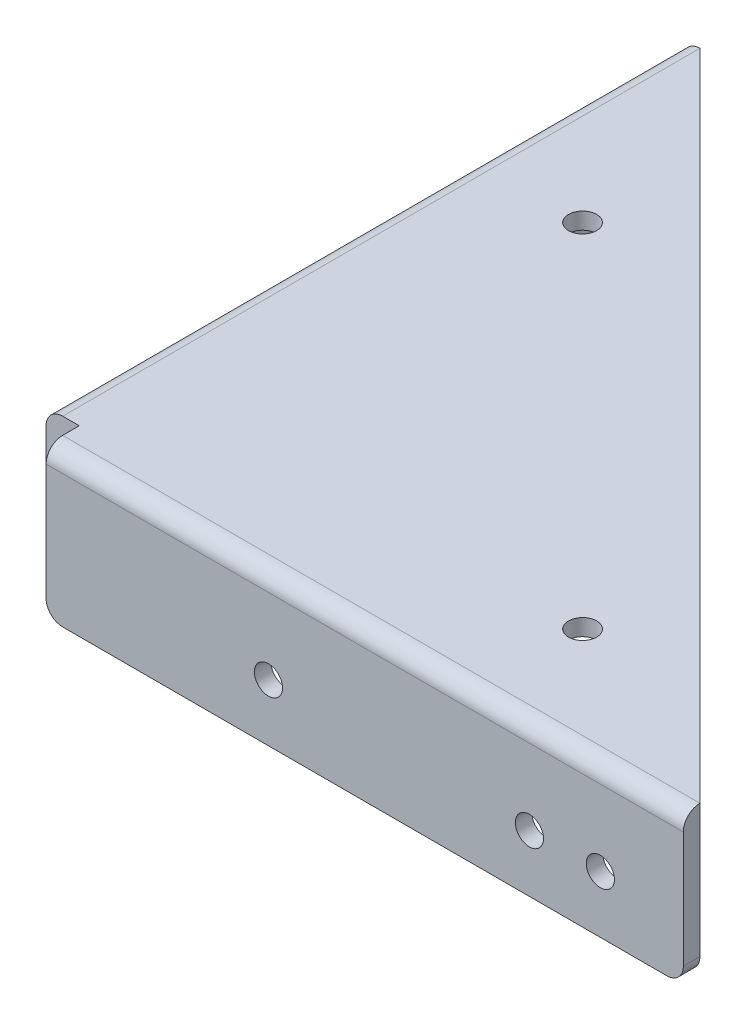
ISO-10303-21;
HEADER;
FILE_DESCRIPTION(('STEP AP214'),'2;1');
FILE_NAME('part.step','',(''),(''),'','','');
FILE_SCHEMA(('AUTOMOTIVE_DESIGN { 1 0 10303 214 1 1 1 1 }'));
ENDSEC;
DATA;
#1=APPLICATION_CONTEXT('core data for automotive mechanical design processes');
#2=APPLICATION_PROTOCOL_DEFINITION('international standard','automotive_design',2000,#1);
#3=PRODUCT_CONTEXT('',#1,'mechanical');
#4=PRODUCT('Part','Part','',(#3));
#5=PRODUCT_RELATED_PRODUCT_CATEGORY('part','',(#4));
#6=PRODUCT_DEFINITION_FORMATION('','',#4);
#7=PRODUCT_DEFINITION_CONTEXT('part definition',#1,'design');
#8=PRODUCT_DEFINITION('design','',#6,#7);
#9=PRODUCT_DEFINITION_SHAPE('','',#8);
#10=(LENGTH_UNIT() NAMED_UNIT(*) SI_UNIT(.MILLI.,.METRE.));
#11=(NAMED_UNIT(*) PLANE_ANGLE_UNIT() SI_UNIT($,.RADIAN.));
#12=(NAMED_UNIT(*) SI_UNIT($,.STERADIAN.) SOLID_ANGLE_UNIT());
#13=UNCERTAINTY_MEASURE_WITH_UNIT(LENGTH_MEASURE(1.E-05),#10,'distance_accuracy_value','');
#14=(GEOMETRIC_REPRESENTATION_CONTEXT(3) GLOBAL_UNCERTAINTY_ASSIGNED_CONTEXT((#13)) GLOBAL_UNIT_ASSIGNED_CONTEXT((#10,
#11,#12)) REPRESENTATION_CONTEXT('',''));
#15=CARTESIAN_POINT('',(0.,0.,0.));
#16=DIRECTION('',(0.,0.,1.));
#17=DIRECTION('',(1.,0.,0.));
#18=AXIS2_PLACEMENT_3D('',#15,#16,#17);
#19=CARTESIAN_POINT('',(0.,22.86,0.));
#20=DIRECTION('',(-1.,0.,0.));
#21=DIRECTION('',(0.,0.,1.));
#22=AXIS2_PLACEMENT_3D('',#19,#20,#21);
#23=PLANE('',#22);
#24=CARTESIAN_POINT('',(0.,8.73125,-79.0575));
#25=DIRECTION('',(-1.,0.,0.));
#26=DIRECTION('',(0.,0.,1.));
#27=AXIS2_PLACEMENT_3D('',#24,#25,#26);
#28=CIRCLE('',#27,2.15899999999999);
#29=CARTESIAN_POINT('',(0.,8.73125,-76.8985));
#30=VERTEX_POINT('',#29);
#31=EDGE_CURVE('E643',#30,#30,#28,.T.);
#32=ORIENTED_EDGE('',*,*,#31,.F.);
#33=EDGE_LOOP('',(#32));
#34=FACE_BOUND('',#33,.T.);
#35=CARTESIAN_POINT('',(0.,8.73125,-39.116));
#36=DIRECTION('',(-1.,0.,0.));
#37=DIRECTION('',(0.,0.,1.));
#38=AXIS2_PLACEMENT_3D('',#35,#36,#37);
#39=CIRCLE('',#38,2.15264999999999);
#40=CARTESIAN_POINT('',(0.,8.73125,-36.96335));
#41=VERTEX_POINT('',#40);
#42=EDGE_CURVE('E254',#41,#41,#39,.T.);
#43=ORIENTED_EDGE('',*,*,#42,.F.);
#44=EDGE_LOOP('',(#43));
#45=FACE_BOUND('',#44,.T.);
#46=CARTESIAN_POINT('',(0.,8.73125,-89.916));
#47=DIRECTION('',(-1.,0.,0.));
#48=DIRECTION('',(0.,0.,1.));
#49=AXIS2_PLACEMENT_3D('',#46,#47,#48);
#50=CIRCLE('',#49,2.15264999999999);
#51=CARTESIAN_POINT('',(0.,8.73125,-87.76335));
#52=VERTEX_POINT('',#51);
#53=EDGE_CURVE('E176',#52,#52,#50,.T.);
#54=ORIENTED_EDGE('',*,*,#53,.F.);
#55=EDGE_LOOP('',(#54));
#56=FACE_BOUND('',#55,.T.);
#57=DIRECTION('',(0.,-1.,0.));
#58=VECTOR('',#57,1.);
#59=CARTESIAN_POINT('',(0.,22.86,-102.616));
#60=LINE('',#59,#58);
#61=CARTESIAN_POINT('',(0.,20.32,-102.616));
#62=VERTEX_POINT('',#61);
#63=CARTESIAN_POINT('',(0.,2.54,-102.616));
#64=VERTEX_POINT('',#63);
#65=EDGE_CURVE('E210',#62,#64,#60,.T.);
#66=ORIENTED_EDGE('',*,*,#65,.T.);
#67=CARTESIAN_POINT('',(0.,2.54,-100.076));
#68=DIRECTION('',(-1.,0.,0.));
#69=DIRECTION('',(0.,0.,1.));
#70=AXIS2_PLACEMENT_3D('',#67,#68,#69);
#71=CIRCLE('',#70,2.54);
#72=CARTESIAN_POINT('',(0.,0.,-100.076));
#73=VERTEX_POINT('',#72);
#74=EDGE_CURVE('E280',#64,#73,#71,.T.);
#75=ORIENTED_EDGE('',*,*,#74,.T.);
#76=DIRECTION('',(0.,0.,-1.));
#77=VECTOR('',#76,1.);
#78=CARTESIAN_POINT('',(0.,0.,0.));
#79=LINE('',#78,#77);
#80=CARTESIAN_POINT('',(0.,0.,-7.61999999999999));
#81=VERTEX_POINT('',#80);
#82=EDGE_CURVE('E202',#81,#73,#79,.T.);
#83=ORIENTED_EDGE('',*,*,#82,.F.);
#84=CARTESIAN_POINT('',(0.,2.54,-7.61999999999999));
#85=DIRECTION('',(-1.,0.,0.));
#86=DIRECTION('',(0.,0.,1.));
#87=AXIS2_PLACEMENT_3D('',#84,#85,#86);
#88=CIRCLE('',#87,2.54);
#89=CARTESIAN_POINT('',(0.,2.54,-5.07999999999999));
#90=VERTEX_POINT('',#89);
#91=EDGE_CURVE('E278',#81,#90,#88,.T.);
#92=ORIENTED_EDGE('',*,*,#91,.T.);
#93=DIRECTION('',(0.,1.,0.));
#94=VECTOR('',#93,1.);
#95=CARTESIAN_POINT('',(0.,22.86,-5.07999999999999));
#96=LINE('',#95,#94);
#97=CARTESIAN_POINT('',(0.,20.32,-5.07999999999999));
#98=VERTEX_POINT('',#97);
#99=EDGE_CURVE('E186',#90,#98,#96,.T.);
#100=ORIENTED_EDGE('',*,*,#99,.T.);
#101=DIRECTION('',(0.,0.,-1.));
#102=VECTOR('',#101,1.);
#103=CARTESIAN_POINT('',(0.,20.32,0.));
#104=LINE('',#103,#102);
#105=EDGE_CURVE('E219',#98,#62,#104,.T.);
#106=ORIENTED_EDGE('',*,*,#105,.T.);
#107=EDGE_LOOP('',(#66,#75,#83,#92,#100,#106));
#108=FACE_BOUND('',#107,.T.);
#109=ADVANCED_FACE('F32',(#34,#45,#56,#108),#23,.T.);
#110=CARTESIAN_POINT('',(0.,22.86,0.));
#111=DIRECTION('',(0.,0.,1.));
#112=DIRECTION('',(1.,0.,0.));
#113=AXIS2_PLACEMENT_3D('',#110,#111,#112);
#114=PLANE('',#113);
#115=CARTESIAN_POINT('',(79.0575,8.73125,0.));
#116=DIRECTION('',(0.,0.,1.));
#117=DIRECTION('',(1.,0.,0.));
#118=AXIS2_PLACEMENT_3D('',#115,#116,#117);
#119=CIRCLE('',#118,2.15899999999999);
#120=CARTESIAN_POINT('',(81.2165,8.73125,0.));
#121=VERTEX_POINT('',#120);
#122=EDGE_CURVE('E649',#121,#121,#119,.T.);
#123=ORIENTED_EDGE('',*,*,#122,.F.);
#124=EDGE_LOOP('',(#123));
#125=FACE_BOUND('',#124,.T.);
#126=CARTESIAN_POINT('',(89.916,8.73125,0.));
#127=DIRECTION('',(0.,0.,1.));
#128=DIRECTION('',(1.,0.,0.));
#129=AXIS2_PLACEMENT_3D('',#126,#127,#128);
#130=CIRCLE('',#129,2.15264999999999);
#131=CARTESIAN_POINT('',(92.06865,8.73125,0.));
#132=VERTEX_POINT('',#131);
#133=EDGE_CURVE('E262',#132,#132,#130,.T.);
#134=ORIENTED_EDGE('',*,*,#133,.F.);
#135=EDGE_LOOP('',(#134));
#136=FACE_BOUND('',#135,.T.);
#137=CARTESIAN_POINT('',(39.116,8.73125,0.));
#138=DIRECTION('',(0.,0.,1.));
#139=DIRECTION('',(1.,0.,0.));
#140=AXIS2_PLACEMENT_3D('',#137,#138,#139);
#141=CIRCLE('',#140,2.15264999999999);
#142=CARTESIAN_POINT('',(41.26865,8.73125,0.));
#143=VERTEX_POINT('',#142);
#144=EDGE_CURVE('E261',#143,#143,#141,.T.);
#145=ORIENTED_EDGE('',*,*,#144,.F.);
#146=EDGE_LOOP('',(#145));
#147=FACE_BOUND('',#146,.T.);
#148=DIRECTION('',(-1.,0.,0.));
#149=VECTOR('',#148,1.);
#150=CARTESIAN_POINT('',(0.,0.,0.));
#151=LINE('',#150,#149);
#152=CARTESIAN_POINT('',(100.076,0.,0.));
#153=VERTEX_POINT('',#152);
#154=CARTESIAN_POINT('',(7.62000000000001,0.,0.));
#155=VERTEX_POINT('',#154);
#156=EDGE_CURVE('E205',#153,#155,#151,.T.);
#157=ORIENTED_EDGE('',*,*,#156,.F.);
#158=CARTESIAN_POINT('',(100.076,2.54,0.));
#159=DIRECTION('',(0.,0.,1.));
#160=DIRECTION('',(1.,0.,0.));
#161=AXIS2_PLACEMENT_3D('',#158,#159,#160);
#162=CIRCLE('',#161,2.54);
#163=CARTESIAN_POINT('',(102.616,2.54,0.));
#164=VERTEX_POINT('',#163);
#165=EDGE_CURVE('E289',#153,#164,#162,.T.);
#166=ORIENTED_EDGE('',*,*,#165,.T.);
#167=DIRECTION('',(0.,-1.,0.));
#168=VECTOR('',#167,1.);
#169=CARTESIAN_POINT('',(102.616,22.86,0.));
#170=LINE('',#169,#168);
#171=CARTESIAN_POINT('',(102.616,20.32,0.));
#172=VERTEX_POINT('',#171);
#173=EDGE_CURVE('E208',#172,#164,#170,.T.);
#174=ORIENTED_EDGE('',*,*,#173,.F.);
#175=DIRECTION('',(-1.,0.,0.));
#176=VECTOR('',#175,1.);
#177=CARTESIAN_POINT('',(0.,20.32,0.));
#178=LINE('',#177,#176);
#179=CARTESIAN_POINT('',(5.08000000000001,20.32,0.));
#180=VERTEX_POINT('',#179);
#181=EDGE_CURVE('E226',#172,#180,#178,.T.);
#182=ORIENTED_EDGE('',*,*,#181,.T.);
#183=DIRECTION('',(0.,-1.,0.));
#184=VECTOR('',#183,1.);
#185=CARTESIAN_POINT('',(5.08000000000001,22.86,0.));
#186=LINE('',#185,#184);
#187=CARTESIAN_POINT('',(5.08000000000001,2.54,0.));
#188=VERTEX_POINT('',#187);
#189=EDGE_CURVE('E161',#180,#188,#186,.T.);
#190=ORIENTED_EDGE('',*,*,#189,.T.);
#191=CARTESIAN_POINT('',(7.62000000000001,2.54,0.));
#192=DIRECTION('',(0.,0.,1.));
#193=DIRECTION('',(1.,0.,0.));
#194=AXIS2_PLACEMENT_3D('',#191,#192,#193);
#195=CIRCLE('',#194,2.54);
#196=EDGE_CURVE('E287',#188,#155,#195,.T.);
#197=ORIENTED_EDGE('',*,*,#196,.T.);
#198=EDGE_LOOP('',(#157,#166,#174,#182,#190,#197));
#199=FACE_BOUND('',#198,.T.);
#200=ADVANCED_FACE('F322',(#125,#136,#147,#199),#114,.T.);
#201=CARTESIAN_POINT('',(0.,22.86,0.));
#202=DIRECTION('',(0.,1.,0.));
#203=DIRECTION('',(0.,0.,1.));
#204=AXIS2_PLACEMENT_3D('',#201,#202,#203);
#205=PLANE('',#204);
#206=CARTESIAN_POINT('',(16.6569755157234,22.86,-70.5385122421383));
#207=DIRECTION('',(0.,1.,0.));
#208=DIRECTION('',(0.,0.,1.));
#209=AXIS2_PLACEMENT_3D('',#206,#207,#208);
#210=CIRCLE('',#209,2.15264999999999);
#211=CARTESIAN_POINT('',(16.6569755157234,22.86,-68.3858622421383));
#212=VERTEX_POINT('',#211);
#213=EDGE_CURVE('E263',#212,#212,#210,.T.);
#214=ORIENTED_EDGE('',*,*,#213,.F.);
#215=EDGE_LOOP('',(#214));
#216=FACE_BOUND('',#215,.T.);
#217=CARTESIAN_POINT('',(70.5385122421383,22.86,-16.6569755157234));
#218=DIRECTION('',(0.,1.,0.));
#219=DIRECTION('',(0.,0.,1.));
#220=AXIS2_PLACEMENT_3D('',#217,#218,#219);
#221=CIRCLE('',#220,2.15264999999999);
#222=CARTESIAN_POINT('',(70.5385122421383,22.86,-14.5043255157234));
#223=VERTEX_POINT('',#222);
#224=EDGE_CURVE('E611',#223,#223,#221,.T.);
#225=ORIENTED_EDGE('',*,*,#224,.F.);
#226=EDGE_LOOP('',(#225));
#227=FACE_BOUND('',#226,.T.);
#228=DIRECTION('',(0.,0.,-1.));
#229=VECTOR('',#228,1.);
#230=CARTESIAN_POINT('',(2.54,22.86,0.));
#231=LINE('',#230,#229);
#232=CARTESIAN_POINT('',(2.54,22.86,-102.616));
#233=VERTEX_POINT('',#232);
#234=CARTESIAN_POINT('',(2.54,22.86,-5.07999999999999));
#235=VERTEX_POINT('',#234);
#236=EDGE_CURVE('E175',#233,#235,#231,.F.);
#237=ORIENTED_EDGE('',*,*,#236,.T.);
#238=DIRECTION('',(1.,0.,0.));
#239=VECTOR('',#238,1.);
#240=CARTESIAN_POINT('',(-2.92435991916569,22.86,-5.07999999999999));
#241=LINE('',#240,#239);
#242=CARTESIAN_POINT('',(5.08000000000001,22.86,-5.07999999999999));
#243=VERTEX_POINT('',#242);
#244=EDGE_CURVE('E154',#235,#243,#241,.T.);
#245=ORIENTED_EDGE('',*,*,#244,.T.);
#246=DIRECTION('',(0.,0.,1.));
#247=VECTOR('',#246,1.);
#248=CARTESIAN_POINT('',(5.08000000000001,22.86,-5.07999999999999));
#249=LINE('',#248,#247);
#250=CARTESIAN_POINT('',(5.08000000000001,22.86,-2.54));
#251=VERTEX_POINT('',#250);
#252=EDGE_CURVE('E162',#243,#251,#249,.T.);
#253=ORIENTED_EDGE('',*,*,#252,.T.);
#254=DIRECTION('',(-1.,0.,0.));
#255=VECTOR('',#254,1.);
#256=CARTESIAN_POINT('',(0.,22.86,-2.54));
#257=LINE('',#256,#255);
#258=CARTESIAN_POINT('',(102.616,22.86,-2.54));
#259=VERTEX_POINT('',#258);
#260=EDGE_CURVE('E223',#251,#259,#257,.F.);
#261=ORIENTED_EDGE('',*,*,#260,.T.);
#262=DIRECTION('',(-0.707106781186547,0.,-0.707106781186547));
#263=VECTOR('',#262,1.);
#264=CARTESIAN_POINT('',(2.54,22.86,-102.616));
#265=LINE('',#264,#263);
#266=EDGE_CURVE('E194',#259,#233,#265,.T.);
#267=ORIENTED_EDGE('',*,*,#266,.T.);
#268=EDGE_LOOP('',(#237,#245,#253,#261,#267));
#269=FACE_BOUND('',#268,.T.);
#270=ADVANCED_FACE('F172',(#216,#227,#269),#205,.T.);
#271=CARTESIAN_POINT('',(0.,0.,0.));
#272=DIRECTION('',(0.,1.,0.));
#273=DIRECTION('',(0.,0.,1.));
#274=AXIS2_PLACEMENT_3D('',#271,#272,#273);
#275=PLANE('',#274);
#276=ORIENTED_EDGE('',*,*,#82,.T.);
#277=DIRECTION('',(1.,0.,0.));
#278=VECTOR('',#277,1.);
#279=CARTESIAN_POINT('',(2.54,0.,-100.076));
#280=LINE('',#279,#278);
#281=CARTESIAN_POINT('',(2.54,0.,-100.076));
#282=VERTEX_POINT('',#281);
#283=EDGE_CURVE('E269',#73,#282,#280,.T.);
#284=ORIENTED_EDGE('',*,*,#283,.T.);
#285=DIRECTION('',(0.,0.,1.));
#286=VECTOR('',#285,1.);
#287=CARTESIAN_POINT('',(2.54000000000001,0.,0.));
#288=LINE('',#287,#286);
#289=CARTESIAN_POINT('',(2.54000000000001,0.,-7.61999999999999));
#290=VERTEX_POINT('',#289);
#291=EDGE_CURVE('E199',#282,#290,#288,.T.);
#292=ORIENTED_EDGE('',*,*,#291,.T.);
#293=DIRECTION('',(1.,0.,0.));
#294=VECTOR('',#293,1.);
#295=CARTESIAN_POINT('',(0.,0.,-7.61999999999999));
#296=LINE('',#295,#294);
#297=EDGE_CURVE('E251',#290,#81,#296,.F.);
#298=ORIENTED_EDGE('',*,*,#297,.T.);
#299=EDGE_LOOP('',(#276,#284,#292,#298));
#300=FACE_BOUND('',#299,.T.);
#301=ADVANCED_FACE('F350',(#300),#275,.F.);
#302=DIRECTION('',(1.,0.,0.));
#303=VECTOR('',#302,1.);
#304=CARTESIAN_POINT('',(0.,0.,-2.53999999999999));
#305=LINE('',#304,#303);
#306=CARTESIAN_POINT('',(7.62000000000001,0.,-2.53999999999999));
#307=VERTEX_POINT('',#306);
#308=CARTESIAN_POINT('',(100.076,0.,-2.53999999999999));
#309=VERTEX_POINT('',#308);
#310=EDGE_CURVE('E193',#307,#309,#305,.T.);
#311=ORIENTED_EDGE('',*,*,#310,.T.);
#312=DIRECTION('',(0.,0.,1.));
#313=VECTOR('',#312,1.);
#314=CARTESIAN_POINT('',(100.076,0.,0.));
#315=LINE('',#314,#313);
#316=EDGE_CURVE('E284',#309,#153,#315,.T.);
#317=ORIENTED_EDGE('',*,*,#316,.T.);
#318=ORIENTED_EDGE('',*,*,#156,.T.);
#319=DIRECTION('',(0.,0.,1.));
#320=VECTOR('',#319,1.);
#321=CARTESIAN_POINT('',(7.62000000000001,0.,-2.53999999999999));
#322=LINE('',#321,#320);
#323=EDGE_CURVE('E282',#155,#307,#322,.F.);
#324=ORIENTED_EDGE('',*,*,#323,.T.);
#325=EDGE_LOOP('',(#311,#317,#318,#324));
#326=FACE_BOUND('',#325,.T.);
#327=ADVANCED_FACE('F324',(#326),#275,.F.);
#328=CARTESIAN_POINT('',(0.,20.32,-2.54));
#329=DIRECTION('',(-1.,0.,0.));
#330=DIRECTION('',(0.,0.,1.));
#331=AXIS2_PLACEMENT_3D('',#328,#329,#330);
#332=CYLINDRICAL_SURFACE('',#331,2.54);
#333=ORIENTED_EDGE('',*,*,#260,.F.);
#334=CARTESIAN_POINT('',(5.08000000000001,20.32,-2.54));
#335=DIRECTION('',(-1.,0.,0.));
#336=DIRECTION('',(0.,0.,1.));
#337=AXIS2_PLACEMENT_3D('',#334,#335,#336);
#338=CIRCLE('',#337,2.54);
#339=EDGE_CURVE('E167',#251,#180,#338,.F.);
#340=ORIENTED_EDGE('',*,*,#339,.T.);
#341=ORIENTED_EDGE('',*,*,#181,.F.);
#342=CARTESIAN_POINT('',(102.616,20.32,-2.54000000000001));
#343=DIRECTION('',(1.,0.,0.));
#344=DIRECTION('',(0.,0.,-1.));
#345=AXIS2_PLACEMENT_3D('',#342,#343,#344);
#346=CIRCLE('',#345,2.54);
#347=EDGE_CURVE('E229',#259,#172,#346,.T.);
#348=ORIENTED_EDGE('',*,*,#347,.F.);
#349=EDGE_LOOP('',(#333,#340,#341,#348));
#350=FACE_BOUND('',#349,.T.);
#351=ADVANCED_FACE('F336',(#350),#332,.T.);
#352=CARTESIAN_POINT('',(2.54,20.32,0.));
#353=DIRECTION('',(0.,0.,-1.));
#354=DIRECTION('',(-1.,0.,0.));
#355=AXIS2_PLACEMENT_3D('',#352,#353,#354);
#356=CYLINDRICAL_SURFACE('',#355,2.54);
#357=ORIENTED_EDGE('',*,*,#105,.F.);
#358=CARTESIAN_POINT('',(2.54,20.32,-5.07999999999999));
#359=DIRECTION('',(0.,0.,1.));
#360=DIRECTION('',(1.,0.,0.));
#361=AXIS2_PLACEMENT_3D('',#358,#359,#360);
#362=CIRCLE('',#361,2.54);
#363=EDGE_CURVE('E188',#98,#235,#362,.F.);
#364=ORIENTED_EDGE('',*,*,#363,.T.);
#365=ORIENTED_EDGE('',*,*,#236,.F.);
#366=CARTESIAN_POINT('',(2.54,20.32,-102.616));
#367=DIRECTION('',(0.,0.,-1.));
#368=DIRECTION('',(-1.,0.,0.));
#369=AXIS2_PLACEMENT_3D('',#366,#367,#368);
#370=CIRCLE('',#369,2.54);
#371=EDGE_CURVE('E221',#62,#233,#370,.T.);
#372=ORIENTED_EDGE('',*,*,#371,.F.);
#373=EDGE_LOOP('',(#357,#364,#365,#372));
#374=FACE_BOUND('',#373,.T.);
#375=ADVANCED_FACE('F342',(#374),#356,.T.);
#376=CARTESIAN_POINT('',(0.,22.86,-2.53999999999999));
#377=DIRECTION('',(0.,0.,-1.));
#378=DIRECTION('',(-1.,0.,0.));
#379=AXIS2_PLACEMENT_3D('',#376,#377,#378);
#380=PLANE('',#379);
#381=CARTESIAN_POINT('',(79.0575,8.73125,-2.53999999999999));
#382=DIRECTION('',(0.,0.,-1.));
#383=DIRECTION('',(-1.,0.,0.));
#384=AXIS2_PLACEMENT_3D('',#381,#382,#383);
#385=CIRCLE('',#384,2.15899999999999);
#386=CARTESIAN_POINT('',(76.8985,8.73125,-2.53999999999999));
#387=VERTEX_POINT('',#386);
#388=EDGE_CURVE('E36',#387,#387,#385,.T.);
#389=ORIENTED_EDGE('',*,*,#388,.F.);
#390=EDGE_LOOP('',(#389));
#391=FACE_BOUND('',#390,.T.);
#392=CARTESIAN_POINT('',(89.916,8.73125,-2.53999999999999));
#393=DIRECTION('',(0.,0.,-1.));
#394=DIRECTION('',(-1.,0.,0.));
#395=AXIS2_PLACEMENT_3D('',#392,#393,#394);
#396=CIRCLE('',#395,2.15264999999999);
#397=CARTESIAN_POINT('',(87.76335,8.73125,-2.53999999999999));
#398=VERTEX_POINT('',#397);
#399=EDGE_CURVE('E258',#398,#398,#396,.T.);
#400=ORIENTED_EDGE('',*,*,#399,.F.);
#401=EDGE_LOOP('',(#400));
#402=FACE_BOUND('',#401,.T.);
#403=CARTESIAN_POINT('',(39.116,8.73125,-2.53999999999999));
#404=DIRECTION('',(0.,0.,-1.));
#405=DIRECTION('',(-1.,0.,0.));
#406=AXIS2_PLACEMENT_3D('',#403,#404,#405);
#407=CIRCLE('',#406,2.15264999999999);
#408=CARTESIAN_POINT('',(36.96335,8.73125,-2.53999999999999));
#409=VERTEX_POINT('',#408);
#410=EDGE_CURVE('E623',#409,#409,#407,.T.);
#411=ORIENTED_EDGE('',*,*,#410,.F.);
#412=EDGE_LOOP('',(#411));
#413=FACE_BOUND('',#412,.T.);
#414=DIRECTION('',(0.,-1.,0.));
#415=VECTOR('',#414,1.);
#416=CARTESIAN_POINT('',(102.616,22.86,-2.54));
#417=LINE('',#416,#415);
#418=CARTESIAN_POINT('',(102.616,17.78,-2.54));
#419=VERTEX_POINT('',#418);
#420=CARTESIAN_POINT('',(102.616,2.54,-2.54));
#421=VERTEX_POINT('',#420);
#422=EDGE_CURVE('E216',#419,#421,#417,.T.);
#423=ORIENTED_EDGE('',*,*,#422,.T.);
#424=CARTESIAN_POINT('',(100.076,2.54,-2.53999999999999));
#425=DIRECTION('',(0.,0.,-1.));
#426=DIRECTION('',(-1.,0.,0.));
#427=AXIS2_PLACEMENT_3D('',#424,#425,#426);
#428=CIRCLE('',#427,2.54);
#429=EDGE_CURVE('E293',#421,#309,#428,.T.);
#430=ORIENTED_EDGE('',*,*,#429,.T.);
#431=ORIENTED_EDGE('',*,*,#310,.F.);
#432=CARTESIAN_POINT('',(7.62000000000001,2.54,-2.53999999999999));
#433=DIRECTION('',(0.,0.,-1.));
#434=DIRECTION('',(-1.,0.,0.));
#435=AXIS2_PLACEMENT_3D('',#432,#433,#434);
#436=CIRCLE('',#435,2.54);
#437=CARTESIAN_POINT('',(5.08000000000001,2.54,-2.53999999999999));
#438=VERTEX_POINT('',#437);
#439=EDGE_CURVE('E48',#307,#438,#436,.T.);
#440=ORIENTED_EDGE('',*,*,#439,.T.);
#441=DIRECTION('',(0.,-1.,0.));
#442=VECTOR('',#441,1.);
#443=CARTESIAN_POINT('',(5.08000000000001,20.32,-2.53999999999999));
#444=LINE('',#443,#442);
#445=CARTESIAN_POINT('',(5.08000000000001,17.78,-2.53999999999999));
#446=VERTEX_POINT('',#445);
#447=EDGE_CURVE('E240',#438,#446,#444,.F.);
#448=ORIENTED_EDGE('',*,*,#447,.T.);
#449=DIRECTION('',(1.,0.,0.));
#450=VECTOR('',#449,1.);
#451=CARTESIAN_POINT('',(0.,17.78,-2.53999999999999));
#452=LINE('',#451,#450);
#453=EDGE_CURVE('E237',#446,#419,#452,.T.);
#454=ORIENTED_EDGE('',*,*,#453,.T.);
#455=EDGE_LOOP('',(#423,#430,#431,#440,#448,#454));
#456=FACE_BOUND('',#455,.T.);
#457=ADVANCED_FACE('F387',(#391,#402,#413,#456),#380,.T.);
#458=CARTESIAN_POINT('',(2.54000000000001,22.86,0.));
#459=DIRECTION('',(1.,0.,0.));
#460=DIRECTION('',(0.,0.,-1.));
#461=AXIS2_PLACEMENT_3D('',#458,#459,#460);
#462=PLANE('',#461);
#463=CARTESIAN_POINT('',(2.54,8.73125,-79.0575));
#464=DIRECTION('',(1.,0.,0.));
#465=DIRECTION('',(0.,0.,-1.));
#466=AXIS2_PLACEMENT_3D('',#463,#464,#465);
#467=CIRCLE('',#466,2.15899999999999);
#468=CARTESIAN_POINT('',(2.54,8.73125,-81.2165));
#469=VERTEX_POINT('',#468);
#470=EDGE_CURVE('E646',#469,#469,#467,.T.);
#471=ORIENTED_EDGE('',*,*,#470,.F.);
#472=EDGE_LOOP('',(#471));
#473=FACE_BOUND('',#472,.T.);
#474=CARTESIAN_POINT('',(2.54000000000001,8.73125,-39.116));
#475=DIRECTION('',(1.,0.,0.));
#476=DIRECTION('',(0.,0.,-1.));
#477=AXIS2_PLACEMENT_3D('',#474,#475,#476);
#478=CIRCLE('',#477,2.15264999999999);
#479=CARTESIAN_POINT('',(2.54000000000001,8.73125,-41.26865));
#480=VERTEX_POINT('',#479);
#481=EDGE_CURVE('E257',#480,#480,#478,.T.);
#482=ORIENTED_EDGE('',*,*,#481,.F.);
#483=EDGE_LOOP('',(#482));
#484=FACE_BOUND('',#483,.T.);
#485=CARTESIAN_POINT('',(2.54,8.73125,-89.916));
#486=DIRECTION('',(1.,0.,0.));
#487=DIRECTION('',(0.,0.,-1.));
#488=AXIS2_PLACEMENT_3D('',#485,#486,#487);
#489=CIRCLE('',#488,2.15264999999999);
#490=CARTESIAN_POINT('',(2.54,8.73125,-92.06865));
#491=VERTEX_POINT('',#490);
#492=EDGE_CURVE('E179',#491,#491,#489,.T.);
#493=ORIENTED_EDGE('',*,*,#492,.F.);
#494=EDGE_LOOP('',(#493));
#495=FACE_BOUND('',#494,.T.);
#496=ORIENTED_EDGE('',*,*,#291,.F.);
#497=CARTESIAN_POINT('',(2.54,2.54,-100.076));
#498=DIRECTION('',(1.,0.,0.));
#499=DIRECTION('',(0.,0.,-1.));
#500=AXIS2_PLACEMENT_3D('',#497,#498,#499);
#501=CIRCLE('',#500,2.54);
#502=CARTESIAN_POINT('',(2.54,2.54,-102.616));
#503=VERTEX_POINT('',#502);
#504=EDGE_CURVE('E274',#282,#503,#501,.T.);
#505=ORIENTED_EDGE('',*,*,#504,.T.);
#506=DIRECTION('',(0.,-1.,0.));
#507=VECTOR('',#506,1.);
#508=CARTESIAN_POINT('',(2.54,22.86,-102.616));
#509=LINE('',#508,#507);
#510=CARTESIAN_POINT('',(2.54,17.78,-102.616));
#511=VERTEX_POINT('',#510);
#512=EDGE_CURVE('E213',#511,#503,#509,.T.);
#513=ORIENTED_EDGE('',*,*,#512,.F.);
#514=DIRECTION('',(0.,0.,1.));
#515=VECTOR('',#514,1.);
#516=CARTESIAN_POINT('',(2.54000000000001,17.78,0.));
#517=LINE('',#516,#515);
#518=CARTESIAN_POINT('',(2.54000000000001,17.78,-5.07999999999999));
#519=VERTEX_POINT('',#518);
#520=EDGE_CURVE('E231',#511,#519,#517,.T.);
#521=ORIENTED_EDGE('',*,*,#520,.T.);
#522=DIRECTION('',(0.,-1.,0.));
#523=VECTOR('',#522,1.);
#524=CARTESIAN_POINT('',(2.54000000000001,0.,-5.07999999999999));
#525=LINE('',#524,#523);
#526=CARTESIAN_POINT('',(2.54000000000001,2.54,-5.07999999999999));
#527=VERTEX_POINT('',#526);
#528=EDGE_CURVE('E234',#519,#527,#525,.T.);
#529=ORIENTED_EDGE('',*,*,#528,.T.);
#530=CARTESIAN_POINT('',(2.54000000000001,2.54,-7.61999999999999));
#531=DIRECTION('',(1.,0.,0.));
#532=DIRECTION('',(0.,0.,-1.));
#533=AXIS2_PLACEMENT_3D('',#530,#531,#532);
#534=CIRCLE('',#533,2.54);
#535=EDGE_CURVE('E272',#527,#290,#534,.T.);
#536=ORIENTED_EDGE('',*,*,#535,.T.);
#537=EDGE_LOOP('',(#496,#505,#513,#521,#529,#536));
#538=FACE_BOUND('',#537,.T.);
#539=ADVANCED_FACE('F301',(#473,#484,#495,#538),#462,.T.);
#540=CARTESIAN_POINT('',(102.616,22.86,0.));
#541=DIRECTION('',(1.,0.,0.));
#542=DIRECTION('',(0.,0.,-1.));
#543=AXIS2_PLACEMENT_3D('',#540,#541,#542);
#544=PLANE('',#543);
#545=ORIENTED_EDGE('',*,*,#173,.T.);
#546=DIRECTION('',(0.,0.,1.));
#547=VECTOR('',#546,1.);
#548=CARTESIAN_POINT('',(102.616,2.54,-2.54));
#549=LINE('',#548,#547);
#550=EDGE_CURVE('E56',#164,#421,#549,.F.);
#551=ORIENTED_EDGE('',*,*,#550,.T.);
#552=ORIENTED_EDGE('',*,*,#422,.F.);
#553=EDGE_CURVE('E217',#259,#419,#417,.T.);
#554=ORIENTED_EDGE('',*,*,#553,.F.);
#555=ORIENTED_EDGE('',*,*,#347,.T.);
#556=EDGE_LOOP('',(#545,#551,#552,#554,#555));
#557=FACE_BOUND('',#556,.T.);
#558=ADVANCED_FACE('F331',(#557),#544,.T.);
#559=CARTESIAN_POINT('',(0.,22.86,-102.616));
#560=DIRECTION('',(0.,0.,-1.));
#561=DIRECTION('',(-1.,0.,0.));
#562=AXIS2_PLACEMENT_3D('',#559,#560,#561);
#563=PLANE('',#562);
#564=ORIENTED_EDGE('',*,*,#512,.T.);
#565=DIRECTION('',(1.,0.,0.));
#566=VECTOR('',#565,1.);
#567=CARTESIAN_POINT('',(0.,2.54,-102.616));
#568=LINE('',#567,#566);
#569=EDGE_CURVE('E276',#503,#64,#568,.F.);
#570=ORIENTED_EDGE('',*,*,#569,.T.);
#571=ORIENTED_EDGE('',*,*,#65,.F.);
#572=ORIENTED_EDGE('',*,*,#371,.T.);
#573=EDGE_CURVE('E214',#233,#511,#509,.T.);
#574=ORIENTED_EDGE('',*,*,#573,.T.);
#575=EDGE_LOOP('',(#564,#570,#571,#572,#574));
#576=FACE_BOUND('',#575,.T.);
#577=ADVANCED_FACE('F355',(#576),#563,.T.);
#578=CARTESIAN_POINT('',(2.54,20.32,-102.616));
#579=DIRECTION('',(0.707106781186548,0.,-0.707106781186548));
#580=DIRECTION('',(-0.707106781186548,0.,-0.707106781186548));
#581=AXIS2_PLACEMENT_3D('',#578,#579,#580);
#582=PLANE('',#581);
#583=ORIENTED_EDGE('',*,*,#266,.F.);
#584=ORIENTED_EDGE('',*,*,#553,.T.);
#585=CARTESIAN_POINT('',(100.076,17.78,-5.07999999999999));
#586=DIRECTION('',(0.707106781186548,0.,-0.707106781186548));
#587=DIRECTION('',(0.707106781186548,0.,0.707106781186548));
#588=AXIS2_PLACEMENT_3D('',#585,#586,#587);
#589=ELLIPSE('',#588,3.59210244842766,2.54);
#590=CARTESIAN_POINT('',(100.076,20.32,-5.08));
#591=VERTEX_POINT('',#590);
#592=EDGE_CURVE('E246',#419,#591,#589,.F.);
#593=ORIENTED_EDGE('',*,*,#592,.T.);
#594=DIRECTION('',(-0.707106781186547,0.,-0.707106781186547));
#595=VECTOR('',#594,1.);
#596=CARTESIAN_POINT('',(2.54,20.32,-102.616));
#597=LINE('',#596,#595);
#598=CARTESIAN_POINT('',(5.08,20.32,-100.076));
#599=VERTEX_POINT('',#598);
#600=EDGE_CURVE('E190',#591,#599,#597,.T.);
#601=ORIENTED_EDGE('',*,*,#600,.T.);
#602=CARTESIAN_POINT('',(5.08,17.78,-100.076));
#603=DIRECTION('',(0.707106781186548,0.,-0.707106781186548));
#604=DIRECTION('',(0.707106781186548,0.,0.707106781186548));
#605=AXIS2_PLACEMENT_3D('',#602,#603,#604);
#606=ELLIPSE('',#605,3.59210244842766,2.54);
#607=EDGE_CURVE('E248',#599,#511,#606,.F.);
#608=ORIENTED_EDGE('',*,*,#607,.T.);
#609=ORIENTED_EDGE('',*,*,#573,.F.);
#610=EDGE_LOOP('',(#583,#584,#593,#601,#608,#609));
#611=FACE_BOUND('',#610,.T.);
#612=ADVANCED_FACE('F385',(#611),#582,.T.);
#613=CARTESIAN_POINT('',(0.,20.32,0.));
#614=DIRECTION('',(0.,1.,0.));
#615=DIRECTION('',(0.,0.,1.));
#616=AXIS2_PLACEMENT_3D('',#613,#614,#615);
#617=PLANE('',#616);
#618=CARTESIAN_POINT('',(16.6569755157234,20.32,-70.5385122421383));
#619=DIRECTION('',(0.,-1.,0.));
#620=DIRECTION('',(0.,0.,-1.));
#621=AXIS2_PLACEMENT_3D('',#618,#619,#620);
#622=CIRCLE('',#621,2.15264999999999);
#623=CARTESIAN_POINT('',(16.6569755157234,20.32,-72.6911622421383));
#624=VERTEX_POINT('',#623);
#625=EDGE_CURVE('E267',#624,#624,#622,.T.);
#626=ORIENTED_EDGE('',*,*,#625,.F.);
#627=EDGE_LOOP('',(#626));
#628=FACE_BOUND('',#627,.T.);
#629=CARTESIAN_POINT('',(70.5385122421383,20.32,-16.6569755157234));
#630=DIRECTION('',(0.,-1.,0.));
#631=DIRECTION('',(0.,0.,-1.));
#632=AXIS2_PLACEMENT_3D('',#629,#630,#631);
#633=CIRCLE('',#632,2.15264999999999);
#634=CARTESIAN_POINT('',(70.5385122421383,20.32,-18.8096255157234));
#635=VERTEX_POINT('',#634);
#636=EDGE_CURVE('E266',#635,#635,#633,.T.);
#637=ORIENTED_EDGE('',*,*,#636,.F.);
#638=EDGE_LOOP('',(#637));
#639=FACE_BOUND('',#638,.T.);
#640=ORIENTED_EDGE('',*,*,#600,.F.);
#641=DIRECTION('',(1.,0.,0.));
#642=VECTOR('',#641,1.);
#643=CARTESIAN_POINT('',(0.,20.32,-5.07999999999999));
#644=LINE('',#643,#642);
#645=CARTESIAN_POINT('',(5.08000000000001,20.32,-5.07999999999999));
#646=VERTEX_POINT('',#645);
#647=EDGE_CURVE('E244',#591,#646,#644,.F.);
#648=ORIENTED_EDGE('',*,*,#647,.T.);
#649=DIRECTION('',(0.,0.,1.));
#650=VECTOR('',#649,1.);
#651=CARTESIAN_POINT('',(5.08000000000001,20.32,0.));
#652=LINE('',#651,#650);
#653=EDGE_CURVE('E242',#646,#599,#652,.F.);
#654=ORIENTED_EDGE('',*,*,#653,.T.);
#655=EDGE_LOOP('',(#640,#648,#654));
#656=FACE_BOUND('',#655,.T.);
#657=ADVANCED_FACE('F400',(#628,#639,#656),#617,.F.);
#658=CARTESIAN_POINT('',(0.,17.78,-5.07999999999999));
#659=DIRECTION('',(1.,0.,0.));
#660=DIRECTION('',(0.,0.,-1.));
#661=AXIS2_PLACEMENT_3D('',#658,#659,#660);
#662=CYLINDRICAL_SURFACE('',#661,2.54);
#663=ORIENTED_EDGE('',*,*,#592,.F.);
#664=ORIENTED_EDGE('',*,*,#453,.F.);
#665=CARTESIAN_POINT('',(5.08000000000001,17.78,-5.07999999999999));
#666=DIRECTION('',(1.,0.,0.));
#667=DIRECTION('',(0.,0.,-1.));
#668=AXIS2_PLACEMENT_3D('',#665,#666,#667);
#669=CIRCLE('',#668,2.54);
#670=EDGE_CURVE('E196',#646,#446,#669,.T.);
#671=ORIENTED_EDGE('',*,*,#670,.F.);
#672=ORIENTED_EDGE('',*,*,#647,.F.);
#673=EDGE_LOOP('',(#663,#664,#671,#672));
#674=FACE_BOUND('',#673,.T.);
#675=ADVANCED_FACE('F316',(#674),#662,.F.);
#676=CARTESIAN_POINT('',(5.08000000000001,17.78,0.));
#677=DIRECTION('',(0.,0.,1.));
#678=DIRECTION('',(1.,0.,0.));
#679=AXIS2_PLACEMENT_3D('',#676,#677,#678);
#680=CYLINDRICAL_SURFACE('',#679,2.54);
#681=ORIENTED_EDGE('',*,*,#607,.F.);
#682=ORIENTED_EDGE('',*,*,#653,.F.);
#683=CARTESIAN_POINT('',(5.08000000000001,17.78,-5.07999999999999));
#684=DIRECTION('',(0.,0.,-1.));
#685=DIRECTION('',(-1.,0.,0.));
#686=AXIS2_PLACEMENT_3D('',#683,#684,#685);
#687=CIRCLE('',#686,2.54);
#688=EDGE_CURVE('E157',#519,#646,#687,.T.);
#689=ORIENTED_EDGE('',*,*,#688,.F.);
#690=ORIENTED_EDGE('',*,*,#520,.F.);
#691=EDGE_LOOP('',(#681,#682,#689,#690));
#692=FACE_BOUND('',#691,.T.);
#693=ADVANCED_FACE('F308',(#692),#680,.F.);
#694=CARTESIAN_POINT('',(-2.92435991916569,-11.684,-5.07999999999999));
#695=DIRECTION('',(0.,0.,1.));
#696=DIRECTION('',(1.,0.,0.));
#697=AXIS2_PLACEMENT_3D('',#694,#695,#696);
#698=PLANE('',#697);
#699=ORIENTED_EDGE('',*,*,#99,.F.);
#700=DIRECTION('',(1.,0.,0.));
#701=VECTOR('',#700,1.);
#702=CARTESIAN_POINT('',(2.54000000000001,2.54,-5.07999999999999));
#703=LINE('',#702,#701);
#704=EDGE_CURVE('E41',#90,#527,#703,.T.);
#705=ORIENTED_EDGE('',*,*,#704,.T.);
#706=ORIENTED_EDGE('',*,*,#528,.F.);
#707=ORIENTED_EDGE('',*,*,#688,.T.);
#708=DIRECTION('',(0.,1.,0.));
#709=VECTOR('',#708,1.);
#710=CARTESIAN_POINT('',(5.08000000000001,-11.684,-5.07999999999999));
#711=LINE('',#710,#709);
#712=EDGE_CURVE('E148',#646,#243,#711,.T.);
#713=ORIENTED_EDGE('',*,*,#712,.T.);
#714=ORIENTED_EDGE('',*,*,#244,.F.);
#715=ORIENTED_EDGE('',*,*,#363,.F.);
#716=EDGE_LOOP('',(#699,#705,#706,#707,#713,#714,#715));
#717=FACE_BOUND('',#716,.T.);
#718=ADVANCED_FACE('F151',(#717),#698,.T.);
#719=CARTESIAN_POINT('',(5.08000000000001,-11.684,-5.07999999999999));
#720=DIRECTION('',(-1.,0.,0.));
#721=DIRECTION('',(0.,0.,1.));
#722=AXIS2_PLACEMENT_3D('',#719,#720,#721);
#723=PLANE('',#722);
#724=ORIENTED_EDGE('',*,*,#447,.F.);
#725=DIRECTION('',(0.,0.,1.));
#726=VECTOR('',#725,1.);
#727=CARTESIAN_POINT('',(5.08000000000001,2.54,0.));
#728=LINE('',#727,#726);
#729=EDGE_CURVE('E11',#438,#188,#728,.T.);
#730=ORIENTED_EDGE('',*,*,#729,.T.);
#731=ORIENTED_EDGE('',*,*,#189,.F.);
#732=ORIENTED_EDGE('',*,*,#339,.F.);
#733=ORIENTED_EDGE('',*,*,#252,.F.);
#734=ORIENTED_EDGE('',*,*,#712,.F.);
#735=ORIENTED_EDGE('',*,*,#670,.T.);
#736=EDGE_LOOP('',(#724,#730,#731,#732,#733,#734,#735));
#737=FACE_BOUND('',#736,.T.);
#738=ADVANCED_FACE('F165',(#737),#723,.T.);
#739=CARTESIAN_POINT('',(2.54,8.73125,-89.916));
#740=DIRECTION('',(1.,0.,0.));
#741=DIRECTION('',(0.,0.,-1.));
#742=AXIS2_PLACEMENT_3D('',#739,#740,#741);
#743=CYLINDRICAL_SURFACE('',#742,2.15264999999999);
#744=ORIENTED_EDGE('',*,*,#53,.T.);
#745=EDGE_LOOP('',(#744));
#746=FACE_BOUND('',#745,.T.);
#747=ORIENTED_EDGE('',*,*,#492,.T.);
#748=EDGE_LOOP('',(#747));
#749=FACE_BOUND('',#748,.T.);
#750=ADVANCED_FACE('F444',(#746,#749),#743,.F.);
#751=CARTESIAN_POINT('',(2.54000000000001,8.73125,-39.116));
#752=DIRECTION('',(1.,0.,0.));
#753=DIRECTION('',(0.,0.,-1.));
#754=AXIS2_PLACEMENT_3D('',#751,#752,#753);
#755=CYLINDRICAL_SURFACE('',#754,2.15264999999999);
#756=ORIENTED_EDGE('',*,*,#42,.T.);
#757=EDGE_LOOP('',(#756));
#758=FACE_BOUND('',#757,.T.);
#759=ORIENTED_EDGE('',*,*,#481,.T.);
#760=EDGE_LOOP('',(#759));
#761=FACE_BOUND('',#760,.T.);
#762=ADVANCED_FACE('F563',(#758,#761),#755,.F.);
#763=CARTESIAN_POINT('',(39.116,8.73125,0.));
#764=DIRECTION('',(0.,0.,1.));
#765=DIRECTION('',(1.,0.,0.));
#766=AXIS2_PLACEMENT_3D('',#763,#764,#765);
#767=CYLINDRICAL_SURFACE('',#766,2.15264999999999);
#768=ORIENTED_EDGE('',*,*,#410,.T.);
#769=EDGE_LOOP('',(#768));
#770=FACE_BOUND('',#769,.T.);
#771=ORIENTED_EDGE('',*,*,#144,.T.);
#772=EDGE_LOOP('',(#771));
#773=FACE_BOUND('',#772,.T.);
#774=ADVANCED_FACE('F573',(#770,#773),#767,.F.);
#775=CARTESIAN_POINT('',(89.916,8.73125,0.));
#776=DIRECTION('',(0.,0.,1.));
#777=DIRECTION('',(1.,0.,0.));
#778=AXIS2_PLACEMENT_3D('',#775,#776,#777);
#779=CYLINDRICAL_SURFACE('',#778,2.15264999999999);
#780=ORIENTED_EDGE('',*,*,#399,.T.);
#781=EDGE_LOOP('',(#780));
#782=FACE_BOUND('',#781,.T.);
#783=ORIENTED_EDGE('',*,*,#133,.T.);
#784=EDGE_LOOP('',(#783));
#785=FACE_BOUND('',#784,.T.);
#786=ADVANCED_FACE('F582',(#782,#785),#779,.F.);
#787=CARTESIAN_POINT('',(70.5385122421383,20.32,-16.6569755157234));
#788=DIRECTION('',(0.,-1.,0.));
#789=DIRECTION('',(0.,0.,-1.));
#790=AXIS2_PLACEMENT_3D('',#787,#788,#789);
#791=CYLINDRICAL_SURFACE('',#790,2.15264999999999);
#792=ORIENTED_EDGE('',*,*,#224,.T.);
#793=EDGE_LOOP('',(#792));
#794=FACE_BOUND('',#793,.T.);
#795=ORIENTED_EDGE('',*,*,#636,.T.);
#796=EDGE_LOOP('',(#795));
#797=FACE_BOUND('',#796,.T.);
#798=ADVANCED_FACE('F365',(#794,#797),#791,.F.);
#799=CARTESIAN_POINT('',(16.6569755157234,20.32,-70.5385122421383));
#800=DIRECTION('',(0.,-1.,0.));
#801=DIRECTION('',(0.,0.,-1.));
#802=AXIS2_PLACEMENT_3D('',#799,#800,#801);
#803=CYLINDRICAL_SURFACE('',#802,2.15264999999999);
#804=ORIENTED_EDGE('',*,*,#213,.T.);
#805=EDGE_LOOP('',(#804));
#806=FACE_BOUND('',#805,.T.);
#807=ORIENTED_EDGE('',*,*,#625,.T.);
#808=EDGE_LOOP('',(#807));
#809=FACE_BOUND('',#808,.T.);
#810=ADVANCED_FACE('F358',(#806,#809),#803,.F.);
#811=CARTESIAN_POINT('',(0.,2.54,-100.076));
#812=DIRECTION('',(-1.,0.,0.));
#813=DIRECTION('',(0.,0.,1.));
#814=AXIS2_PLACEMENT_3D('',#811,#812,#813);
#815=CYLINDRICAL_SURFACE('',#814,2.54);
#816=ORIENTED_EDGE('',*,*,#74,.F.);
#817=ORIENTED_EDGE('',*,*,#569,.F.);
#818=ORIENTED_EDGE('',*,*,#504,.F.);
#819=ORIENTED_EDGE('',*,*,#283,.F.);
#820=EDGE_LOOP('',(#816,#817,#818,#819));
#821=FACE_BOUND('',#820,.T.);
#822=ADVANCED_FACE('F356',(#821),#815,.T.);
#823=CARTESIAN_POINT('',(100.076,2.54,0.));
#824=DIRECTION('',(0.,0.,-1.));
#825=DIRECTION('',(-1.,0.,0.));
#826=AXIS2_PLACEMENT_3D('',#823,#824,#825);
#827=CYLINDRICAL_SURFACE('',#826,2.54);
#828=ORIENTED_EDGE('',*,*,#429,.F.);
#829=ORIENTED_EDGE('',*,*,#550,.F.);
#830=ORIENTED_EDGE('',*,*,#165,.F.);
#831=ORIENTED_EDGE('',*,*,#316,.F.);
#832=EDGE_LOOP('',(#828,#829,#830,#831));
#833=FACE_BOUND('',#832,.T.);
#834=ADVANCED_FACE('F328',(#833),#827,.T.);
#835=CARTESIAN_POINT('',(-2.92435991916569,2.54,-7.61999999999999));
#836=DIRECTION('',(-1.,0.,0.));
#837=DIRECTION('',(0.,0.,1.));
#838=AXIS2_PLACEMENT_3D('',#835,#836,#837);
#839=CYLINDRICAL_SURFACE('',#838,2.54);
#840=ORIENTED_EDGE('',*,*,#91,.F.);
#841=ORIENTED_EDGE('',*,*,#297,.F.);
#842=ORIENTED_EDGE('',*,*,#535,.F.);
#843=ORIENTED_EDGE('',*,*,#704,.F.);
#844=EDGE_LOOP('',(#840,#841,#842,#843));
#845=FACE_BOUND('',#844,.T.);
#846=ADVANCED_FACE('F348',(#845),#839,.T.);
#847=CARTESIAN_POINT('',(7.62000000000001,2.54,-5.07999999999999));
#848=DIRECTION('',(0.,0.,-1.));
#849=DIRECTION('',(-1.,0.,0.));
#850=AXIS2_PLACEMENT_3D('',#847,#848,#849);
#851=CYLINDRICAL_SURFACE('',#850,2.54);
#852=ORIENTED_EDGE('',*,*,#439,.F.);
#853=ORIENTED_EDGE('',*,*,#323,.F.);
#854=ORIENTED_EDGE('',*,*,#196,.F.);
#855=ORIENTED_EDGE('',*,*,#729,.F.);
#856=EDGE_LOOP('',(#852,#853,#854,#855));
#857=FACE_BOUND('',#856,.T.);
#858=ADVANCED_FACE('F34',(#857),#851,.T.);
#859=CARTESIAN_POINT('',(-5.08,8.73125,-79.0575));
#860=DIRECTION('',(1.,0.,0.));
#861=DIRECTION('',(0.,0.,-1.));
#862=AXIS2_PLACEMENT_3D('',#859,#860,#861);
#863=CYLINDRICAL_SURFACE('',#862,2.15899999999999);
#864=ORIENTED_EDGE('',*,*,#31,.T.);
#865=EDGE_LOOP('',(#864));
#866=FACE_BOUND('',#865,.T.);
#867=ORIENTED_EDGE('',*,*,#470,.T.);
#868=EDGE_LOOP('',(#867));
#869=FACE_BOUND('',#868,.T.);
#870=ADVANCED_FACE('F469',(#866,#869),#863,.F.);
#871=CARTESIAN_POINT('',(79.0575,8.73125,-7.62));
#872=DIRECTION('',(0.,0.,1.));
#873=DIRECTION('',(1.,0.,0.));
#874=AXIS2_PLACEMENT_3D('',#871,#872,#873);
#875=CYLINDRICAL_SURFACE('',#874,2.15899999999999);
#876=ORIENTED_EDGE('',*,*,#388,.T.);
#877=EDGE_LOOP('',(#876));
#878=FACE_BOUND('',#877,.T.);
#879=ORIENTED_EDGE('',*,*,#122,.T.);
#880=EDGE_LOOP('',(#879));
#881=FACE_BOUND('',#880,.T.);
#882=ADVANCED_FACE('F478',(#878,#881),#875,.F.);
#883=CLOSED_SHELL('',(#109,#200,#270,#301,#327,#351,#375,#457,#539,#558,#577,#612,#657,#675,
#693,#718,#738,#750,#762,#774,#786,#798,#810,#822,#834,#846,#858,#870,#882));
#884=MANIFOLD_SOLID_BREP('B2',#883);
#885=ADVANCED_BREP_SHAPE_REPRESENTATION('',(#18,#884),#14);
#886=SHAPE_DEFINITION_REPRESENTATION(#9,#885);
ENDSEC;
END-ISO-10303-21;
